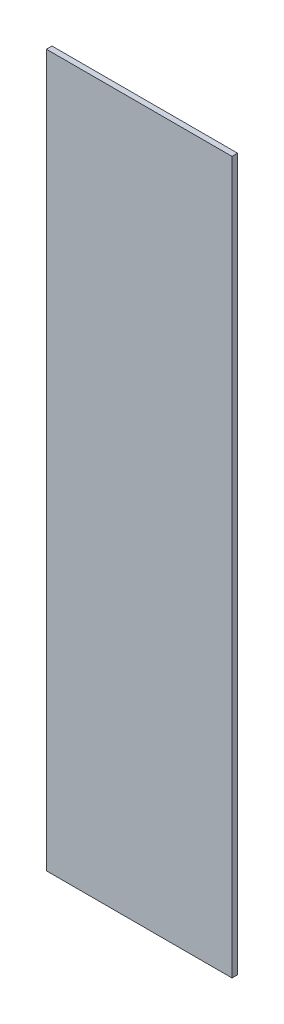
ISO-10303-21;
HEADER;
FILE_DESCRIPTION(('STEP AP214'),'2;1');
FILE_NAME('part.step','',(''),(''),'','','');
FILE_SCHEMA(('AUTOMOTIVE_DESIGN { 1 0 10303 214 1 1 1 1 }'));
ENDSEC;
DATA;
#1=APPLICATION_CONTEXT('core data for automotive mechanical design processes');
#2=APPLICATION_PROTOCOL_DEFINITION('international standard','automotive_design',2000,#1);
#3=PRODUCT_CONTEXT('',#1,'mechanical');
#4=PRODUCT('Part','Part','',(#3));
#5=PRODUCT_RELATED_PRODUCT_CATEGORY('part','',(#4));
#6=PRODUCT_DEFINITION_FORMATION('','',#4);
#7=PRODUCT_DEFINITION_CONTEXT('part definition',#1,'design');
#8=PRODUCT_DEFINITION('design','',#6,#7);
#9=PRODUCT_DEFINITION_SHAPE('','',#8);
#10=(LENGTH_UNIT() NAMED_UNIT(*) SI_UNIT(.MILLI.,.METRE.));
#11=(NAMED_UNIT(*) PLANE_ANGLE_UNIT() SI_UNIT($,.RADIAN.));
#12=(NAMED_UNIT(*) SI_UNIT($,.STERADIAN.) SOLID_ANGLE_UNIT());
#13=UNCERTAINTY_MEASURE_WITH_UNIT(LENGTH_MEASURE(1.E-05),#10,'distance_accuracy_value','');
#14=(GEOMETRIC_REPRESENTATION_CONTEXT(3) GLOBAL_UNCERTAINTY_ASSIGNED_CONTEXT((#13)) GLOBAL_UNIT_ASSIGNED_CONTEXT((#10,
#11,#12)) REPRESENTATION_CONTEXT('',''));
#15=CARTESIAN_POINT('',(0.,0.,0.));
#16=DIRECTION('',(0.,0.,1.));
#17=DIRECTION('',(1.,0.,0.));
#18=AXIS2_PLACEMENT_3D('',#15,#16,#17);
#19=CARTESIAN_POINT('',(0.,0.,18.));
#20=DIRECTION('',(1.,0.,0.));
#21=DIRECTION('',(0.,0.,-1.));
#22=AXIS2_PLACEMENT_3D('',#19,#20,#21);
#23=PLANE('',#22);
#24=DIRECTION('',(0.,-1.,0.));
#25=VECTOR('',#24,1.);
#26=CARTESIAN_POINT('',(0.,0.,0.));
#27=LINE('',#26,#25);
#28=CARTESIAN_POINT('',(0.,2300.,0.));
#29=VERTEX_POINT('',#28);
#30=CARTESIAN_POINT('',(0.,0.,0.));
#31=VERTEX_POINT('',#30);
#32=EDGE_CURVE('E98',#29,#31,#27,.T.);
#33=ORIENTED_EDGE('',*,*,#32,.T.);
#34=DIRECTION('',(0.,0.,-1.));
#35=VECTOR('',#34,1.);
#36=CARTESIAN_POINT('',(0.,0.,18.));
#37=LINE('',#36,#35);
#38=CARTESIAN_POINT('',(0.,0.,18.));
#39=VERTEX_POINT('',#38);
#40=EDGE_CURVE('E11',#39,#31,#37,.T.);
#41=ORIENTED_EDGE('',*,*,#40,.F.);
#42=DIRECTION('',(0.,-1.,0.));
#43=VECTOR('',#42,1.);
#44=CARTESIAN_POINT('',(0.,0.,18.));
#45=LINE('',#44,#43);
#46=CARTESIAN_POINT('',(0.,2300.,18.));
#47=VERTEX_POINT('',#46);
#48=EDGE_CURVE('E86',#47,#39,#45,.T.);
#49=ORIENTED_EDGE('',*,*,#48,.F.);
#50=DIRECTION('',(0.,0.,-1.));
#51=VECTOR('',#50,1.);
#52=CARTESIAN_POINT('',(0.,2300.,18.));
#53=LINE('',#52,#51);
#54=EDGE_CURVE('E94',#47,#29,#53,.T.);
#55=ORIENTED_EDGE('',*,*,#54,.T.);
#56=EDGE_LOOP('',(#33,#41,#49,#55));
#57=FACE_BOUND('',#56,.T.);
#58=ADVANCED_FACE('F35',(#57),#23,.F.);
#59=CARTESIAN_POINT('',(0.,0.,18.));
#60=DIRECTION('',(0.,1.,0.));
#61=DIRECTION('',(0.,0.,1.));
#62=AXIS2_PLACEMENT_3D('',#59,#60,#61);
#63=PLANE('',#62);
#64=DIRECTION('',(1.,0.,0.));
#65=VECTOR('',#64,1.);
#66=CARTESIAN_POINT('',(0.,0.,0.));
#67=LINE('',#66,#65);
#68=CARTESIAN_POINT('',(600.,0.,0.));
#69=VERTEX_POINT('',#68);
#70=EDGE_CURVE('E90',#31,#69,#67,.T.);
#71=ORIENTED_EDGE('',*,*,#70,.T.);
#72=DIRECTION('',(0.,0.,-1.));
#73=VECTOR('',#72,1.);
#74=CARTESIAN_POINT('',(600.,0.,18.));
#75=LINE('',#74,#73);
#76=CARTESIAN_POINT('',(600.,0.,18.));
#77=VERTEX_POINT('',#76);
#78=EDGE_CURVE('E43',#77,#69,#75,.T.);
#79=ORIENTED_EDGE('',*,*,#78,.F.);
#80=DIRECTION('',(1.,0.,0.));
#81=VECTOR('',#80,1.);
#82=CARTESIAN_POINT('',(0.,0.,18.));
#83=LINE('',#82,#81);
#84=EDGE_CURVE('E81',#39,#77,#83,.T.);
#85=ORIENTED_EDGE('',*,*,#84,.F.);
#86=ORIENTED_EDGE('',*,*,#40,.T.);
#87=EDGE_LOOP('',(#71,#79,#85,#86));
#88=FACE_BOUND('',#87,.T.);
#89=ADVANCED_FACE('F89',(#88),#63,.F.);
#90=CARTESIAN_POINT('',(600.,0.,18.));
#91=DIRECTION('',(-1.,0.,0.));
#92=DIRECTION('',(0.,0.,1.));
#93=AXIS2_PLACEMENT_3D('',#90,#91,#92);
#94=PLANE('',#93);
#95=DIRECTION('',(0.,1.,0.));
#96=VECTOR('',#95,1.);
#97=CARTESIAN_POINT('',(600.,0.,0.));
#98=LINE('',#97,#96);
#99=CARTESIAN_POINT('',(600.,2300.,0.));
#100=VERTEX_POINT('',#99);
#101=EDGE_CURVE('E68',#69,#100,#98,.T.);
#102=ORIENTED_EDGE('',*,*,#101,.T.);
#103=DIRECTION('',(0.,0.,-1.));
#104=VECTOR('',#103,1.);
#105=CARTESIAN_POINT('',(600.,2300.,18.));
#106=LINE('',#105,#104);
#107=CARTESIAN_POINT('',(600.,2300.,18.));
#108=VERTEX_POINT('',#107);
#109=EDGE_CURVE('E91',#108,#100,#106,.T.);
#110=ORIENTED_EDGE('',*,*,#109,.F.);
#111=DIRECTION('',(0.,1.,0.));
#112=VECTOR('',#111,1.);
#113=CARTESIAN_POINT('',(600.,0.,18.));
#114=LINE('',#113,#112);
#115=EDGE_CURVE('E84',#77,#108,#114,.T.);
#116=ORIENTED_EDGE('',*,*,#115,.F.);
#117=ORIENTED_EDGE('',*,*,#78,.T.);
#118=EDGE_LOOP('',(#102,#110,#116,#117));
#119=FACE_BOUND('',#118,.T.);
#120=ADVANCED_FACE('F92',(#119),#94,.F.);
#121=CARTESIAN_POINT('',(0.,2300.,18.));
#122=DIRECTION('',(0.,-1.,0.));
#123=DIRECTION('',(0.,0.,-1.));
#124=AXIS2_PLACEMENT_3D('',#121,#122,#123);
#125=PLANE('',#124);
#126=DIRECTION('',(-1.,0.,0.));
#127=VECTOR('',#126,1.);
#128=CARTESIAN_POINT('',(0.,2300.,0.));
#129=LINE('',#128,#127);
#130=EDGE_CURVE('E74',#100,#29,#129,.T.);
#131=ORIENTED_EDGE('',*,*,#130,.T.);
#132=ORIENTED_EDGE('',*,*,#54,.F.);
#133=DIRECTION('',(-1.,0.,0.));
#134=VECTOR('',#133,1.);
#135=CARTESIAN_POINT('',(0.,2300.,18.));
#136=LINE('',#135,#134);
#137=EDGE_CURVE('E51',#108,#47,#136,.T.);
#138=ORIENTED_EDGE('',*,*,#137,.F.);
#139=ORIENTED_EDGE('',*,*,#109,.T.);
#140=EDGE_LOOP('',(#131,#132,#138,#139));
#141=FACE_BOUND('',#140,.T.);
#142=ADVANCED_FACE('F105',(#141),#125,.F.);
#143=CARTESIAN_POINT('',(0.,0.,18.));
#144=DIRECTION('',(0.,0.,-1.));
#145=DIRECTION('',(-1.,0.,0.));
#146=AXIS2_PLACEMENT_3D('',#143,#144,#145);
#147=PLANE('',#146);
#148=ORIENTED_EDGE('',*,*,#48,.T.);
#149=ORIENTED_EDGE('',*,*,#84,.T.);
#150=ORIENTED_EDGE('',*,*,#115,.T.);
#151=ORIENTED_EDGE('',*,*,#137,.T.);
#152=EDGE_LOOP('',(#148,#149,#150,#151));
#153=FACE_BOUND('',#152,.T.);
#154=ADVANCED_FACE('F82',(#153),#147,.F.);
#155=CARTESIAN_POINT('',(0.,0.,0.));
#156=DIRECTION('',(0.,0.,-1.));
#157=DIRECTION('',(-1.,0.,0.));
#158=AXIS2_PLACEMENT_3D('',#155,#156,#157);
#159=PLANE('',#158);
#160=ORIENTED_EDGE('',*,*,#32,.F.);
#161=ORIENTED_EDGE('',*,*,#130,.F.);
#162=ORIENTED_EDGE('',*,*,#101,.F.);
#163=ORIENTED_EDGE('',*,*,#70,.F.);
#164=EDGE_LOOP('',(#160,#161,#162,#163));
#165=FACE_BOUND('',#164,.T.);
#166=ADVANCED_FACE('F108',(#165),#159,.T.);
#167=CLOSED_SHELL('',(#58,#89,#120,#142,#154,#166));
#168=MANIFOLD_SOLID_BREP('B2',#167);
#169=ADVANCED_BREP_SHAPE_REPRESENTATION('',(#18,#168),#14);
#170=SHAPE_DEFINITION_REPRESENTATION(#9,#169);
ENDSEC;
END-ISO-10303-21;
